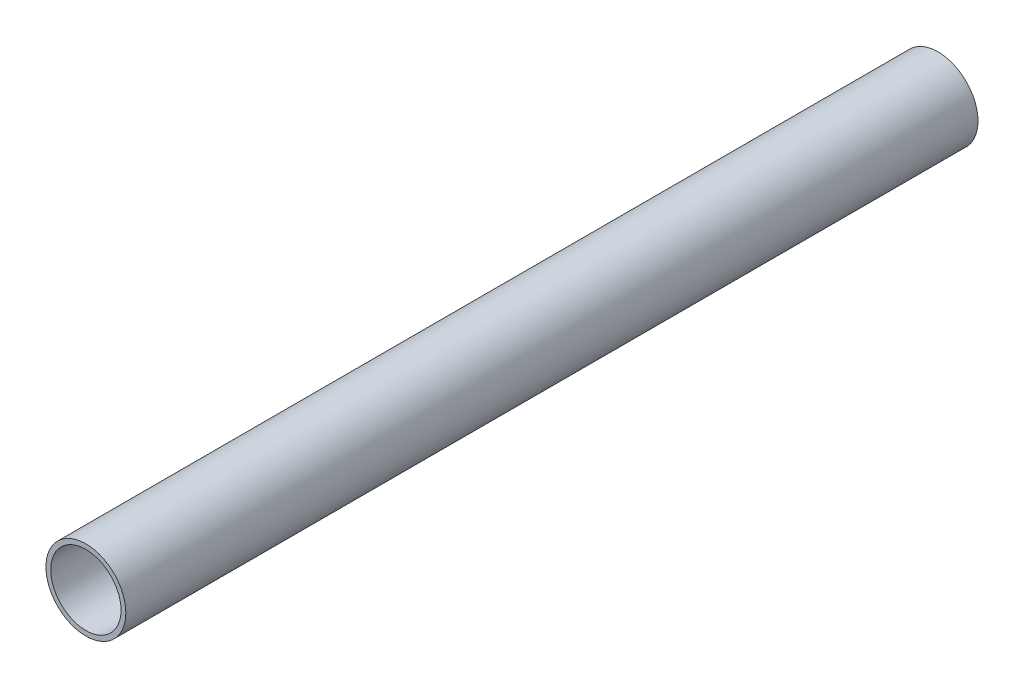
ISO-10303-21;
HEADER;
FILE_DESCRIPTION(('STEP AP214'),'2;1');
FILE_NAME('part.step','',(''),(''),'','','');
FILE_SCHEMA(('AUTOMOTIVE_DESIGN { 1 0 10303 214 1 1 1 1 }'));
ENDSEC;
DATA;
#1=APPLICATION_CONTEXT('core data for automotive mechanical design processes');
#2=APPLICATION_PROTOCOL_DEFINITION('international standard','automotive_design',2000,#1);
#3=PRODUCT_CONTEXT('',#1,'mechanical');
#4=PRODUCT('Part','Part','',(#3));
#5=PRODUCT_RELATED_PRODUCT_CATEGORY('part','',(#4));
#6=PRODUCT_DEFINITION_FORMATION('','',#4);
#7=PRODUCT_DEFINITION_CONTEXT('part definition',#1,'design');
#8=PRODUCT_DEFINITION('design','',#6,#7);
#9=PRODUCT_DEFINITION_SHAPE('','',#8);
#10=(LENGTH_UNIT() NAMED_UNIT(*) SI_UNIT(.MILLI.,.METRE.));
#11=(NAMED_UNIT(*) PLANE_ANGLE_UNIT() SI_UNIT($,.RADIAN.));
#12=(NAMED_UNIT(*) SI_UNIT($,.STERADIAN.) SOLID_ANGLE_UNIT());
#13=UNCERTAINTY_MEASURE_WITH_UNIT(LENGTH_MEASURE(1.E-05),#10,'distance_accuracy_value','');
#14=(GEOMETRIC_REPRESENTATION_CONTEXT(3) GLOBAL_UNCERTAINTY_ASSIGNED_CONTEXT((#13)) GLOBAL_UNIT_ASSIGNED_CONTEXT((#10,
#11,#12)) REPRESENTATION_CONTEXT('',''));
#15=CARTESIAN_POINT('',(0.,0.,0.));
#16=DIRECTION('',(0.,0.,1.));
#17=DIRECTION('',(1.,0.,0.));
#18=AXIS2_PLACEMENT_3D('',#15,#16,#17);
#19=CARTESIAN_POINT('',(0.,0.,203.2));
#20=DIRECTION('',(0.,0.,1.));
#21=DIRECTION('',(1.,0.,0.));
#22=AXIS2_PLACEMENT_3D('',#19,#20,#21);
#23=PLANE('',#22);
#24=CARTESIAN_POINT('',(0.,0.,203.2));
#25=DIRECTION('',(0.,0.,1.));
#26=DIRECTION('',(1.,0.,0.));
#27=AXIS2_PLACEMENT_3D('',#24,#25,#26);
#28=CIRCLE('',#27,9.525);
#29=CARTESIAN_POINT('',(9.525,0.,203.2));
#30=VERTEX_POINT('',#29);
#31=EDGE_CURVE('E10',#30,#30,#28,.T.);
#32=ORIENTED_EDGE('',*,*,#31,.T.);
#33=EDGE_LOOP('',(#32));
#34=FACE_BOUND('',#33,.T.);
#35=CARTESIAN_POINT('',(0.,0.,203.2));
#36=DIRECTION('',(0.,0.,1.));
#37=DIRECTION('',(1.,0.,0.));
#38=AXIS2_PLACEMENT_3D('',#35,#36,#37);
#39=CIRCLE('',#38,8.382);
#40=CARTESIAN_POINT('',(8.382,0.,203.2));
#41=VERTEX_POINT('',#40);
#42=EDGE_CURVE('E43',#41,#41,#39,.T.);
#43=ORIENTED_EDGE('',*,*,#42,.F.);
#44=EDGE_LOOP('',(#43));
#45=FACE_BOUND('',#44,.T.);
#46=ADVANCED_FACE('F32',(#34,#45),#23,.T.);
#47=CARTESIAN_POINT('',(0.,0.,0.));
#48=DIRECTION('',(0.,0.,1.));
#49=DIRECTION('',(1.,0.,0.));
#50=AXIS2_PLACEMENT_3D('',#47,#48,#49);
#51=PLANE('',#50);
#52=CARTESIAN_POINT('',(0.,0.,0.));
#53=DIRECTION('',(0.,0.,1.));
#54=DIRECTION('',(1.,0.,0.));
#55=AXIS2_PLACEMENT_3D('',#52,#53,#54);
#56=CIRCLE('',#55,9.525);
#57=CARTESIAN_POINT('',(9.525,0.,0.));
#58=VERTEX_POINT('',#57);
#59=EDGE_CURVE('E36',#58,#58,#56,.T.);
#60=ORIENTED_EDGE('',*,*,#59,.F.);
#61=EDGE_LOOP('',(#60));
#62=FACE_BOUND('',#61,.T.);
#63=CARTESIAN_POINT('',(0.,0.,0.));
#64=DIRECTION('',(0.,0.,1.));
#65=DIRECTION('',(1.,0.,0.));
#66=AXIS2_PLACEMENT_3D('',#63,#64,#65);
#67=CIRCLE('',#66,8.382);
#68=CARTESIAN_POINT('',(8.382,0.,0.));
#69=VERTEX_POINT('',#68);
#70=EDGE_CURVE('E45',#69,#69,#67,.T.);
#71=ORIENTED_EDGE('',*,*,#70,.T.);
#72=EDGE_LOOP('',(#71));
#73=FACE_BOUND('',#72,.T.);
#74=ADVANCED_FACE('F55',(#62,#73),#51,.F.);
#75=CARTESIAN_POINT('',(0.,0.,203.2));
#76=DIRECTION('',(0.,0.,-1.));
#77=DIRECTION('',(-1.,0.,0.));
#78=AXIS2_PLACEMENT_3D('',#75,#76,#77);
#79=CYLINDRICAL_SURFACE('',#78,9.525);
#80=ORIENTED_EDGE('',*,*,#31,.F.);
#81=EDGE_LOOP('',(#80));
#82=FACE_BOUND('',#81,.T.);
#83=ORIENTED_EDGE('',*,*,#59,.T.);
#84=EDGE_LOOP('',(#83));
#85=FACE_BOUND('',#84,.T.);
#86=ADVANCED_FACE('F34',(#82,#85),#79,.T.);
#87=CARTESIAN_POINT('',(0.,0.,203.2));
#88=DIRECTION('',(0.,0.,-1.));
#89=DIRECTION('',(-1.,0.,0.));
#90=AXIS2_PLACEMENT_3D('',#87,#88,#89);
#91=CYLINDRICAL_SURFACE('',#90,8.382);
#92=ORIENTED_EDGE('',*,*,#42,.T.);
#93=EDGE_LOOP('',(#92));
#94=FACE_BOUND('',#93,.T.);
#95=ORIENTED_EDGE('',*,*,#70,.F.);
#96=EDGE_LOOP('',(#95));
#97=FACE_BOUND('',#96,.T.);
#98=ADVANCED_FACE('F51',(#94,#97),#91,.F.);
#99=CLOSED_SHELL('',(#46,#74,#86,#98));
#100=MANIFOLD_SOLID_BREP('B2',#99);
#101=ADVANCED_BREP_SHAPE_REPRESENTATION('',(#18,#100),#14);
#102=SHAPE_DEFINITION_REPRESENTATION(#9,#101);
ENDSEC;
END-ISO-10303-21;
